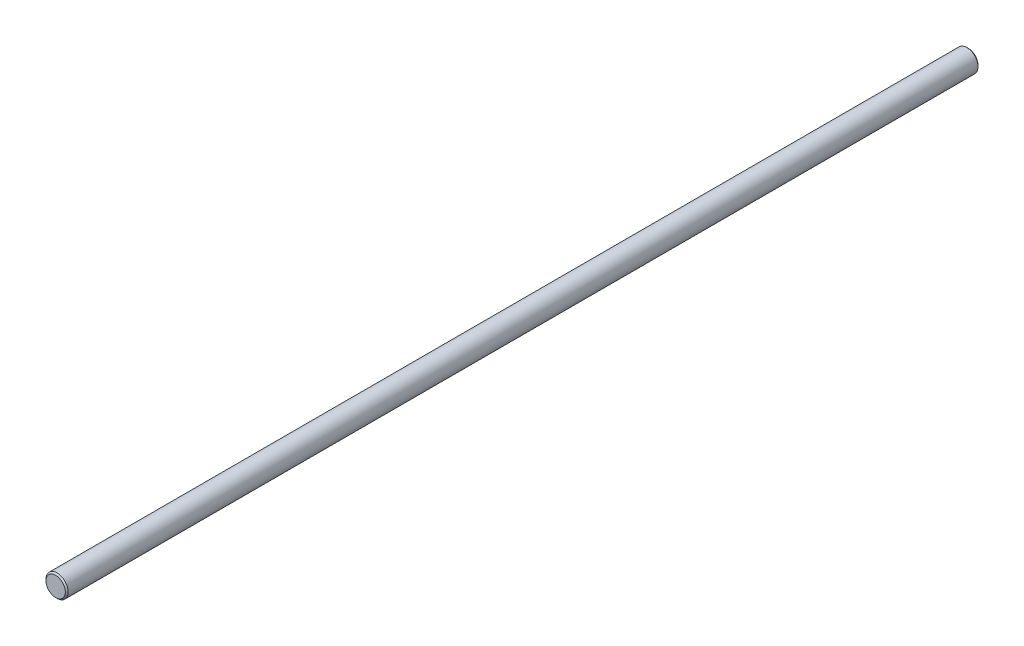
ISO-10303-21;
HEADER;
FILE_DESCRIPTION(('STEP AP214'),'2;1');
FILE_NAME('part.step','',(''),(''),'','','');
FILE_SCHEMA(('AUTOMOTIVE_DESIGN { 1 0 10303 214 1 1 1 1 }'));
ENDSEC;
DATA;
#1=APPLICATION_CONTEXT('core data for automotive mechanical design processes');
#2=APPLICATION_PROTOCOL_DEFINITION('international standard','automotive_design',2000,#1);
#3=PRODUCT_CONTEXT('',#1,'mechanical');
#4=PRODUCT('Part','Part','',(#3));
#5=PRODUCT_RELATED_PRODUCT_CATEGORY('part','',(#4));
#6=PRODUCT_DEFINITION_FORMATION('','',#4);
#7=PRODUCT_DEFINITION_CONTEXT('part definition',#1,'design');
#8=PRODUCT_DEFINITION('design','',#6,#7);
#9=PRODUCT_DEFINITION_SHAPE('','',#8);
#10=(LENGTH_UNIT() NAMED_UNIT(*) SI_UNIT(.MILLI.,.METRE.));
#11=(NAMED_UNIT(*) PLANE_ANGLE_UNIT() SI_UNIT($,.RADIAN.));
#12=(NAMED_UNIT(*) SI_UNIT($,.STERADIAN.) SOLID_ANGLE_UNIT());
#13=UNCERTAINTY_MEASURE_WITH_UNIT(LENGTH_MEASURE(1.E-05),#10,'distance_accuracy_value','');
#14=(GEOMETRIC_REPRESENTATION_CONTEXT(3) GLOBAL_UNCERTAINTY_ASSIGNED_CONTEXT((#13)) GLOBAL_UNIT_ASSIGNED_CONTEXT((#10,
#11,#12)) REPRESENTATION_CONTEXT('',''));
#15=CARTESIAN_POINT('',(0.,0.,0.));
#16=DIRECTION('',(0.,0.,1.));
#17=DIRECTION('',(1.,0.,0.));
#18=AXIS2_PLACEMENT_3D('',#15,#16,#17);
#19=CARTESIAN_POINT('',(0.,0.,-330.));
#20=DIRECTION('',(0.,0.,1.));
#21=DIRECTION('',(1.,0.,0.));
#22=AXIS2_PLACEMENT_3D('',#19,#20,#21);
#23=CYLINDRICAL_SURFACE('',#22,4.);
#24=CARTESIAN_POINT('',(0.,0.,-329.5));
#25=DIRECTION('',(0.,0.,1.));
#26=DIRECTION('',(1.,0.,0.));
#27=AXIS2_PLACEMENT_3D('',#24,#25,#26);
#28=CIRCLE('',#27,4.);
#29=CARTESIAN_POINT('',(4.,0.,-329.5));
#30=VERTEX_POINT('',#29);
#31=EDGE_CURVE('E45',#30,#30,#28,.T.);
#32=ORIENTED_EDGE('',*,*,#31,.T.);
#33=EDGE_LOOP('',(#32));
#34=FACE_BOUND('',#33,.T.);
#35=CARTESIAN_POINT('',(0.,0.,-0.5));
#36=DIRECTION('',(0.,0.,1.));
#37=DIRECTION('',(1.,0.,0.));
#38=AXIS2_PLACEMENT_3D('',#35,#36,#37);
#39=CIRCLE('',#38,4.);
#40=CARTESIAN_POINT('',(4.,0.,-0.5));
#41=VERTEX_POINT('',#40);
#42=EDGE_CURVE('E49',#41,#41,#39,.F.);
#43=ORIENTED_EDGE('',*,*,#42,.T.);
#44=EDGE_LOOP('',(#43));
#45=FACE_BOUND('',#44,.T.);
#46=ADVANCED_FACE('F34',(#34,#45),#23,.T.);
#47=CARTESIAN_POINT('',(0.,0.,-330.));
#48=DIRECTION('',(0.,0.,1.));
#49=DIRECTION('',(1.,0.,0.));
#50=AXIS2_PLACEMENT_3D('',#47,#48,#49);
#51=PLANE('',#50);
#52=CARTESIAN_POINT('',(0.,0.,-330.));
#53=DIRECTION('',(0.,0.,1.));
#54=DIRECTION('',(1.,0.,0.));
#55=AXIS2_PLACEMENT_3D('',#52,#53,#54);
#56=CIRCLE('',#55,3.49999999999998);
#57=CARTESIAN_POINT('',(3.49999999999998,0.,-330.));
#58=VERTEX_POINT('',#57);
#59=EDGE_CURVE('E41',#58,#58,#56,.F.);
#60=ORIENTED_EDGE('',*,*,#59,.T.);
#61=EDGE_LOOP('',(#60));
#62=FACE_BOUND('',#61,.T.);
#63=ADVANCED_FACE('F65',(#62),#51,.F.);
#64=CARTESIAN_POINT('',(0.,0.,0.));
#65=DIRECTION('',(0.,0.,1.));
#66=DIRECTION('',(1.,0.,0.));
#67=AXIS2_PLACEMENT_3D('',#64,#65,#66);
#68=PLANE('',#67);
#69=CARTESIAN_POINT('',(0.,0.,0.));
#70=DIRECTION('',(0.,0.,1.));
#71=DIRECTION('',(1.,0.,0.));
#72=AXIS2_PLACEMENT_3D('',#69,#70,#71);
#73=CIRCLE('',#72,3.5);
#74=CARTESIAN_POINT('',(3.5,0.,0.));
#75=VERTEX_POINT('',#74);
#76=EDGE_CURVE('E10',#75,#75,#73,.T.);
#77=ORIENTED_EDGE('',*,*,#76,.T.);
#78=EDGE_LOOP('',(#77));
#79=FACE_BOUND('',#78,.T.);
#80=ADVANCED_FACE('F62',(#79),#68,.T.);
#81=CARTESIAN_POINT('',(0.,0.,-329.5));
#82=DIRECTION('',(0.,0.,1.));
#83=DIRECTION('',(1.,0.,0.));
#84=AXIS2_PLACEMENT_3D('',#81,#82,#83);
#85=CONICAL_SURFACE('',#84,4.,0.785398163397473);
#86=ORIENTED_EDGE('',*,*,#59,.F.);
#87=EDGE_LOOP('',(#86));
#88=FACE_BOUND('',#87,.T.);
#89=ORIENTED_EDGE('',*,*,#31,.F.);
#90=EDGE_LOOP('',(#89));
#91=FACE_BOUND('',#90,.T.);
#92=ADVANCED_FACE('F58',(#88,#91),#85,.T.);
#93=CARTESIAN_POINT('',(0.,0.,0.));
#94=DIRECTION('',(0.,0.,-1.));
#95=DIRECTION('',(-1.,0.,0.));
#96=AXIS2_PLACEMENT_3D('',#93,#94,#95);
#97=CONICAL_SURFACE('',#96,3.5,0.785398163397445);
#98=ORIENTED_EDGE('',*,*,#42,.F.);
#99=EDGE_LOOP('',(#98));
#100=FACE_BOUND('',#99,.T.);
#101=ORIENTED_EDGE('',*,*,#76,.F.);
#102=EDGE_LOOP('',(#101));
#103=FACE_BOUND('',#102,.T.);
#104=ADVANCED_FACE('F36',(#100,#103),#97,.T.);
#105=CLOSED_SHELL('',(#46,#63,#80,#92,#104));
#106=MANIFOLD_SOLID_BREP('B2',#105);
#107=ADVANCED_BREP_SHAPE_REPRESENTATION('',(#18,#106),#14);
#108=SHAPE_DEFINITION_REPRESENTATION(#9,#107);
ENDSEC;
END-ISO-10303-21;
